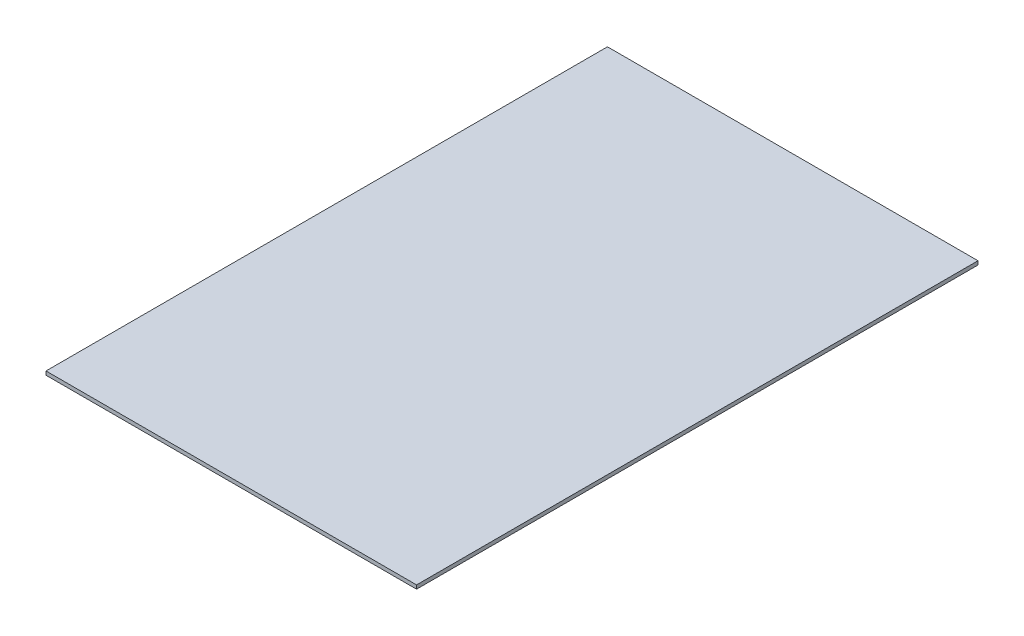
ISO-10303-21;
HEADER;
FILE_DESCRIPTION(('STEP AP214'),'2;1');
FILE_NAME('part.step','',(''),(''),'','','');
FILE_SCHEMA(('AUTOMOTIVE_DESIGN { 1 0 10303 214 1 1 1 1 }'));
ENDSEC;
DATA;
#1=APPLICATION_CONTEXT('core data for automotive mechanical design processes');
#2=APPLICATION_PROTOCOL_DEFINITION('international standard','automotive_design',2000,#1);
#3=PRODUCT_CONTEXT('',#1,'mechanical');
#4=PRODUCT('Part','Part','',(#3));
#5=PRODUCT_RELATED_PRODUCT_CATEGORY('part','',(#4));
#6=PRODUCT_DEFINITION_FORMATION('','',#4);
#7=PRODUCT_DEFINITION_CONTEXT('part definition',#1,'design');
#8=PRODUCT_DEFINITION('design','',#6,#7);
#9=PRODUCT_DEFINITION_SHAPE('','',#8);
#10=(LENGTH_UNIT() NAMED_UNIT(*) SI_UNIT(.MILLI.,.METRE.));
#11=(NAMED_UNIT(*) PLANE_ANGLE_UNIT() SI_UNIT($,.RADIAN.));
#12=(NAMED_UNIT(*) SI_UNIT($,.STERADIAN.) SOLID_ANGLE_UNIT());
#13=UNCERTAINTY_MEASURE_WITH_UNIT(LENGTH_MEASURE(1.E-05),#10,'distance_accuracy_value','');
#14=(GEOMETRIC_REPRESENTATION_CONTEXT(3) GLOBAL_UNCERTAINTY_ASSIGNED_CONTEXT((#13)) GLOBAL_UNIT_ASSIGNED_CONTEXT((#10,
#11,#12)) REPRESENTATION_CONTEXT('',''));
#15=CARTESIAN_POINT('',(0.,0.,0.));
#16=DIRECTION('',(0.,0.,1.));
#17=DIRECTION('',(1.,0.,0.));
#18=AXIS2_PLACEMENT_3D('',#15,#16,#17);
#19=CARTESIAN_POINT('',(-99.,2.,-150.));
#20=DIRECTION('',(1.,0.,0.));
#21=DIRECTION('',(0.,0.,-1.));
#22=AXIS2_PLACEMENT_3D('',#19,#20,#21);
#23=PLANE('',#22);
#24=DIRECTION('',(0.,0.,1.));
#25=VECTOR('',#24,1.);
#26=CARTESIAN_POINT('',(-99.,0.,-150.));
#27=LINE('',#26,#25);
#28=CARTESIAN_POINT('',(-99.,0.,-150.));
#29=VERTEX_POINT('',#28);
#30=CARTESIAN_POINT('',(-99.,0.,150.));
#31=VERTEX_POINT('',#30);
#32=EDGE_CURVE('E109',#29,#31,#27,.T.);
#33=ORIENTED_EDGE('',*,*,#32,.T.);
#34=DIRECTION('',(0.,-1.,0.));
#35=VECTOR('',#34,1.);
#36=CARTESIAN_POINT('',(-99.,2.,150.));
#37=LINE('',#36,#35);
#38=CARTESIAN_POINT('',(-99.,2.,150.));
#39=VERTEX_POINT('',#38);
#40=EDGE_CURVE('E11',#39,#31,#37,.T.);
#41=ORIENTED_EDGE('',*,*,#40,.F.);
#42=DIRECTION('',(0.,0.,1.));
#43=VECTOR('',#42,1.);
#44=CARTESIAN_POINT('',(-99.,2.,-150.));
#45=LINE('',#44,#43);
#46=CARTESIAN_POINT('',(-99.,2.,-150.));
#47=VERTEX_POINT('',#46);
#48=EDGE_CURVE('E93',#47,#39,#45,.T.);
#49=ORIENTED_EDGE('',*,*,#48,.F.);
#50=DIRECTION('',(0.,-1.,0.));
#51=VECTOR('',#50,1.);
#52=CARTESIAN_POINT('',(-99.,2.,-150.));
#53=LINE('',#52,#51);
#54=EDGE_CURVE('E105',#47,#29,#53,.T.);
#55=ORIENTED_EDGE('',*,*,#54,.T.);
#56=EDGE_LOOP('',(#33,#41,#49,#55));
#57=FACE_BOUND('',#56,.T.);
#58=ADVANCED_FACE('F41',(#57),#23,.F.);
#59=CARTESIAN_POINT('',(99.,2.,150.));
#60=DIRECTION('',(0.,0.,-1.));
#61=DIRECTION('',(-1.,0.,0.));
#62=AXIS2_PLACEMENT_3D('',#59,#60,#61);
#63=PLANE('',#62);
#64=DIRECTION('',(1.,0.,0.));
#65=VECTOR('',#64,1.);
#66=CARTESIAN_POINT('',(99.,0.,150.));
#67=LINE('',#66,#65);
#68=CARTESIAN_POINT('',(99.,0.,150.));
#69=VERTEX_POINT('',#68);
#70=EDGE_CURVE('E98',#31,#69,#67,.T.);
#71=ORIENTED_EDGE('',*,*,#70,.T.);
#72=DIRECTION('',(0.,-1.,0.));
#73=VECTOR('',#72,1.);
#74=CARTESIAN_POINT('',(99.,2.,150.));
#75=LINE('',#74,#73);
#76=CARTESIAN_POINT('',(99.,2.,150.));
#77=VERTEX_POINT('',#76);
#78=EDGE_CURVE('E50',#77,#69,#75,.T.);
#79=ORIENTED_EDGE('',*,*,#78,.F.);
#80=DIRECTION('',(1.,0.,0.));
#81=VECTOR('',#80,1.);
#82=CARTESIAN_POINT('',(99.,2.,150.));
#83=LINE('',#82,#81);
#84=EDGE_CURVE('E88',#39,#77,#83,.T.);
#85=ORIENTED_EDGE('',*,*,#84,.F.);
#86=ORIENTED_EDGE('',*,*,#40,.T.);
#87=EDGE_LOOP('',(#71,#79,#85,#86));
#88=FACE_BOUND('',#87,.T.);
#89=ADVANCED_FACE('F97',(#88),#63,.F.);
#90=CARTESIAN_POINT('',(99.,2.,-150.));
#91=DIRECTION('',(-1.,0.,0.));
#92=DIRECTION('',(0.,0.,1.));
#93=AXIS2_PLACEMENT_3D('',#90,#91,#92);
#94=PLANE('',#93);
#95=DIRECTION('',(0.,0.,-1.));
#96=VECTOR('',#95,1.);
#97=CARTESIAN_POINT('',(99.,0.,-150.));
#98=LINE('',#97,#96);
#99=CARTESIAN_POINT('',(99.,0.,-150.));
#100=VERTEX_POINT('',#99);
#101=EDGE_CURVE('E75',#69,#100,#98,.T.);
#102=ORIENTED_EDGE('',*,*,#101,.T.);
#103=DIRECTION('',(0.,-1.,0.));
#104=VECTOR('',#103,1.);
#105=CARTESIAN_POINT('',(99.,2.,-150.));
#106=LINE('',#105,#104);
#107=CARTESIAN_POINT('',(99.,2.,-150.));
#108=VERTEX_POINT('',#107);
#109=EDGE_CURVE('E100',#108,#100,#106,.T.);
#110=ORIENTED_EDGE('',*,*,#109,.F.);
#111=DIRECTION('',(0.,0.,-1.));
#112=VECTOR('',#111,1.);
#113=CARTESIAN_POINT('',(99.,2.,-150.));
#114=LINE('',#113,#112);
#115=EDGE_CURVE('E91',#77,#108,#114,.T.);
#116=ORIENTED_EDGE('',*,*,#115,.F.);
#117=ORIENTED_EDGE('',*,*,#78,.T.);
#118=EDGE_LOOP('',(#102,#110,#116,#117));
#119=FACE_BOUND('',#118,.T.);
#120=ADVANCED_FACE('F101',(#119),#94,.F.);
#121=CARTESIAN_POINT('',(99.,2.,-150.));
#122=DIRECTION('',(0.,0.,1.));
#123=DIRECTION('',(1.,0.,0.));
#124=AXIS2_PLACEMENT_3D('',#121,#122,#123);
#125=PLANE('',#124);
#126=DIRECTION('',(-1.,0.,0.));
#127=VECTOR('',#126,1.);
#128=CARTESIAN_POINT('',(99.,0.,-150.));
#129=LINE('',#128,#127);
#130=EDGE_CURVE('E81',#100,#29,#129,.T.);
#131=ORIENTED_EDGE('',*,*,#130,.T.);
#132=ORIENTED_EDGE('',*,*,#54,.F.);
#133=DIRECTION('',(-1.,0.,0.));
#134=VECTOR('',#133,1.);
#135=CARTESIAN_POINT('',(99.,2.,-150.));
#136=LINE('',#135,#134);
#137=EDGE_CURVE('E58',#108,#47,#136,.T.);
#138=ORIENTED_EDGE('',*,*,#137,.F.);
#139=ORIENTED_EDGE('',*,*,#109,.T.);
#140=EDGE_LOOP('',(#131,#132,#138,#139));
#141=FACE_BOUND('',#140,.T.);
#142=ADVANCED_FACE('F122',(#141),#125,.F.);
#143=CARTESIAN_POINT('',(0.,2.,0.));
#144=DIRECTION('',(0.,-1.,0.));
#145=DIRECTION('',(0.,0.,-1.));
#146=AXIS2_PLACEMENT_3D('',#143,#144,#145);
#147=PLANE('',#146);
#148=ORIENTED_EDGE('',*,*,#48,.T.);
#149=ORIENTED_EDGE('',*,*,#84,.T.);
#150=ORIENTED_EDGE('',*,*,#115,.T.);
#151=ORIENTED_EDGE('',*,*,#137,.T.);
#152=EDGE_LOOP('',(#148,#149,#150,#151));
#153=FACE_BOUND('',#152,.T.);
#154=ADVANCED_FACE('F89',(#153),#147,.F.);
#155=CARTESIAN_POINT('',(0.,0.,0.));
#156=DIRECTION('',(0.,-1.,0.));
#157=DIRECTION('',(0.,0.,-1.));
#158=AXIS2_PLACEMENT_3D('',#155,#156,#157);
#159=PLANE('',#158);
#160=ORIENTED_EDGE('',*,*,#32,.F.);
#161=ORIENTED_EDGE('',*,*,#130,.F.);
#162=ORIENTED_EDGE('',*,*,#101,.F.);
#163=ORIENTED_EDGE('',*,*,#70,.F.);
#164=EDGE_LOOP('',(#160,#161,#162,#163));
#165=FACE_BOUND('',#164,.T.);
#166=ADVANCED_FACE('F125',(#165),#159,.T.);
#167=CLOSED_SHELL('',(#58,#89,#120,#142,#154,#166));
#168=MANIFOLD_SOLID_BREP('B2',#167);
#169=ADVANCED_BREP_SHAPE_REPRESENTATION('',(#18,#168),#14);
#170=SHAPE_DEFINITION_REPRESENTATION(#9,#169);
ENDSEC;
END-ISO-10303-21;
